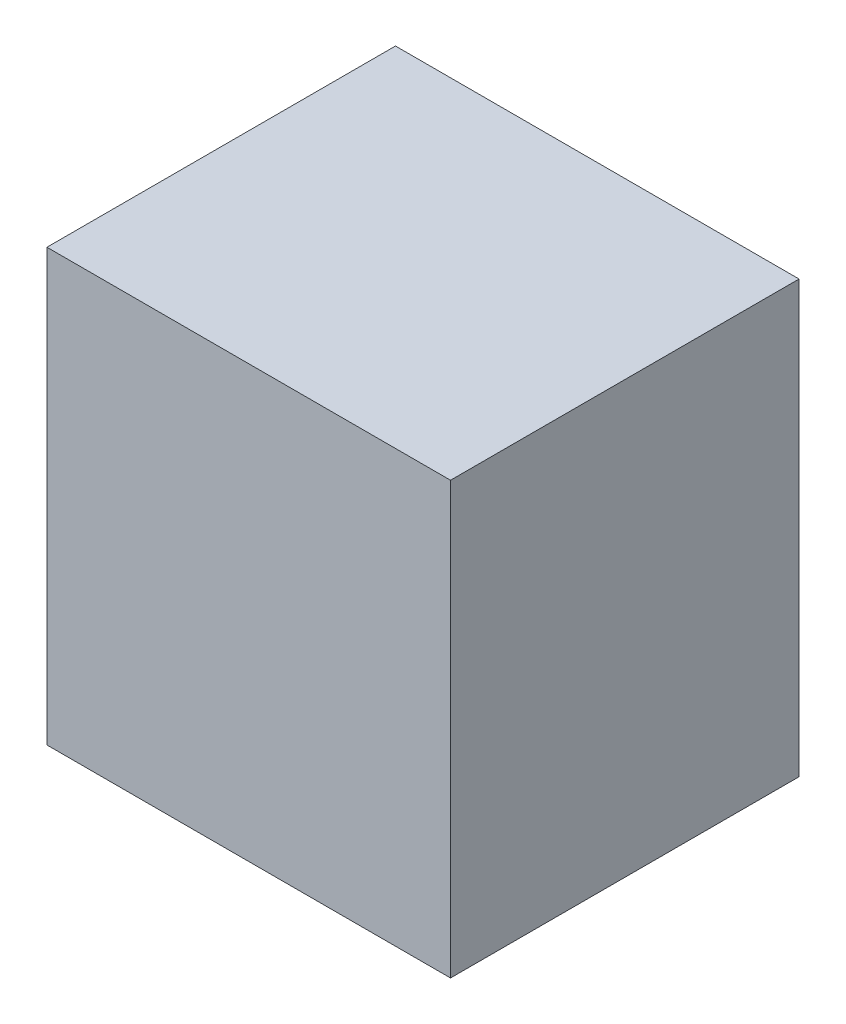
ISO-10303-21;
HEADER;
FILE_DESCRIPTION(('STEP AP214'),'2;1');
FILE_NAME('part.step','',(''),(''),'','','');
FILE_SCHEMA(('AUTOMOTIVE_DESIGN { 1 0 10303 214 1 1 1 1 }'));
ENDSEC;
DATA;
#1=APPLICATION_CONTEXT('core data for automotive mechanical design processes');
#2=APPLICATION_PROTOCOL_DEFINITION('international standard','automotive_design',2000,#1);
#3=PRODUCT_CONTEXT('',#1,'mechanical');
#4=PRODUCT('Part','Part','',(#3));
#5=PRODUCT_RELATED_PRODUCT_CATEGORY('part','',(#4));
#6=PRODUCT_DEFINITION_FORMATION('','',#4);
#7=PRODUCT_DEFINITION_CONTEXT('part definition',#1,'design');
#8=PRODUCT_DEFINITION('design','',#6,#7);
#9=PRODUCT_DEFINITION_SHAPE('','',#8);
#10=(LENGTH_UNIT() NAMED_UNIT(*) SI_UNIT(.MILLI.,.METRE.));
#11=(NAMED_UNIT(*) PLANE_ANGLE_UNIT() SI_UNIT($,.RADIAN.));
#12=(NAMED_UNIT(*) SI_UNIT($,.STERADIAN.) SOLID_ANGLE_UNIT());
#13=UNCERTAINTY_MEASURE_WITH_UNIT(LENGTH_MEASURE(1.E-05),#10,'distance_accuracy_value','');
#14=(GEOMETRIC_REPRESENTATION_CONTEXT(3) GLOBAL_UNCERTAINTY_ASSIGNED_CONTEXT((#13)) GLOBAL_UNIT_ASSIGNED_CONTEXT((#10,
#11,#12)) REPRESENTATION_CONTEXT('',''));
#15=CARTESIAN_POINT('',(0.,0.,0.));
#16=DIRECTION('',(0.,0.,1.));
#17=DIRECTION('',(1.,0.,0.));
#18=AXIS2_PLACEMENT_3D('',#15,#16,#17);
#19=CARTESIAN_POINT('',(0.,94.,0.));
#20=DIRECTION('',(1.,0.,0.));
#21=DIRECTION('',(0.,0.,-1.));
#22=AXIS2_PLACEMENT_3D('',#19,#20,#21);
#23=PLANE('',#22);
#24=DIRECTION('',(0.,0.,1.));
#25=VECTOR('',#24,1.);
#26=CARTESIAN_POINT('',(0.,0.,0.));
#27=LINE('',#26,#25);
#28=CARTESIAN_POINT('',(0.,0.,-76.));
#29=VERTEX_POINT('',#28);
#30=CARTESIAN_POINT('',(0.,0.,0.));
#31=VERTEX_POINT('',#30);
#32=EDGE_CURVE('E111',#29,#31,#27,.T.);
#33=ORIENTED_EDGE('',*,*,#32,.T.);
#34=DIRECTION('',(0.,-1.,0.));
#35=VECTOR('',#34,1.);
#36=CARTESIAN_POINT('',(0.,94.,0.));
#37=LINE('',#36,#35);
#38=CARTESIAN_POINT('',(0.,94.,0.));
#39=VERTEX_POINT('',#38);
#40=EDGE_CURVE('E11',#39,#31,#37,.T.);
#41=ORIENTED_EDGE('',*,*,#40,.F.);
#42=DIRECTION('',(0.,0.,1.));
#43=VECTOR('',#42,1.);
#44=CARTESIAN_POINT('',(0.,94.,0.));
#45=LINE('',#44,#43);
#46=CARTESIAN_POINT('',(0.,94.,-76.));
#47=VERTEX_POINT('',#46);
#48=EDGE_CURVE('E95',#47,#39,#45,.T.);
#49=ORIENTED_EDGE('',*,*,#48,.F.);
#50=DIRECTION('',(0.,-1.,0.));
#51=VECTOR('',#50,1.);
#52=CARTESIAN_POINT('',(0.,94.,-76.));
#53=LINE('',#52,#51);
#54=EDGE_CURVE('E107',#47,#29,#53,.T.);
#55=ORIENTED_EDGE('',*,*,#54,.T.);
#56=EDGE_LOOP('',(#33,#41,#49,#55));
#57=FACE_BOUND('',#56,.T.);
#58=ADVANCED_FACE('F43',(#57),#23,.F.);
#59=CARTESIAN_POINT('',(0.,94.,0.));
#60=DIRECTION('',(0.,0.,-1.));
#61=DIRECTION('',(-1.,0.,0.));
#62=AXIS2_PLACEMENT_3D('',#59,#60,#61);
#63=PLANE('',#62);
#64=DIRECTION('',(1.,0.,0.));
#65=VECTOR('',#64,1.);
#66=CARTESIAN_POINT('',(0.,0.,0.));
#67=LINE('',#66,#65);
#68=CARTESIAN_POINT('',(88.,0.,0.));
#69=VERTEX_POINT('',#68);
#70=EDGE_CURVE('E100',#31,#69,#67,.T.);
#71=ORIENTED_EDGE('',*,*,#70,.T.);
#72=DIRECTION('',(0.,-1.,0.));
#73=VECTOR('',#72,1.);
#74=CARTESIAN_POINT('',(88.,94.,0.));
#75=LINE('',#74,#73);
#76=CARTESIAN_POINT('',(88.,94.,0.));
#77=VERTEX_POINT('',#76);
#78=EDGE_CURVE('E52',#77,#69,#75,.T.);
#79=ORIENTED_EDGE('',*,*,#78,.F.);
#80=DIRECTION('',(1.,0.,0.));
#81=VECTOR('',#80,1.);
#82=CARTESIAN_POINT('',(0.,94.,0.));
#83=LINE('',#82,#81);
#84=EDGE_CURVE('E90',#39,#77,#83,.T.);
#85=ORIENTED_EDGE('',*,*,#84,.F.);
#86=ORIENTED_EDGE('',*,*,#40,.T.);
#87=EDGE_LOOP('',(#71,#79,#85,#86));
#88=FACE_BOUND('',#87,.T.);
#89=ADVANCED_FACE('F99',(#88),#63,.F.);
#90=CARTESIAN_POINT('',(88.,94.,0.));
#91=DIRECTION('',(-1.,0.,0.));
#92=DIRECTION('',(0.,0.,1.));
#93=AXIS2_PLACEMENT_3D('',#90,#91,#92);
#94=PLANE('',#93);
#95=DIRECTION('',(0.,0.,-1.));
#96=VECTOR('',#95,1.);
#97=CARTESIAN_POINT('',(88.,0.,0.));
#98=LINE('',#97,#96);
#99=CARTESIAN_POINT('',(88.,0.,-76.));
#100=VERTEX_POINT('',#99);
#101=EDGE_CURVE('E77',#69,#100,#98,.T.);
#102=ORIENTED_EDGE('',*,*,#101,.T.);
#103=DIRECTION('',(0.,-1.,0.));
#104=VECTOR('',#103,1.);
#105=CARTESIAN_POINT('',(88.,94.,-76.));
#106=LINE('',#105,#104);
#107=CARTESIAN_POINT('',(88.,94.,-76.));
#108=VERTEX_POINT('',#107);
#109=EDGE_CURVE('E102',#108,#100,#106,.T.);
#110=ORIENTED_EDGE('',*,*,#109,.F.);
#111=DIRECTION('',(0.,0.,-1.));
#112=VECTOR('',#111,1.);
#113=CARTESIAN_POINT('',(88.,94.,0.));
#114=LINE('',#113,#112);
#115=EDGE_CURVE('E93',#77,#108,#114,.T.);
#116=ORIENTED_EDGE('',*,*,#115,.F.);
#117=ORIENTED_EDGE('',*,*,#78,.T.);
#118=EDGE_LOOP('',(#102,#110,#116,#117));
#119=FACE_BOUND('',#118,.T.);
#120=ADVANCED_FACE('F103',(#119),#94,.F.);
#121=CARTESIAN_POINT('',(0.,94.,-76.));
#122=DIRECTION('',(0.,0.,1.));
#123=DIRECTION('',(1.,0.,0.));
#124=AXIS2_PLACEMENT_3D('',#121,#122,#123);
#125=PLANE('',#124);
#126=DIRECTION('',(-1.,0.,0.));
#127=VECTOR('',#126,1.);
#128=CARTESIAN_POINT('',(0.,0.,-76.));
#129=LINE('',#128,#127);
#130=EDGE_CURVE('E83',#100,#29,#129,.T.);
#131=ORIENTED_EDGE('',*,*,#130,.T.);
#132=ORIENTED_EDGE('',*,*,#54,.F.);
#133=DIRECTION('',(-1.,0.,0.));
#134=VECTOR('',#133,1.);
#135=CARTESIAN_POINT('',(0.,94.,-76.));
#136=LINE('',#135,#134);
#137=EDGE_CURVE('E60',#108,#47,#136,.T.);
#138=ORIENTED_EDGE('',*,*,#137,.F.);
#139=ORIENTED_EDGE('',*,*,#109,.T.);
#140=EDGE_LOOP('',(#131,#132,#138,#139));
#141=FACE_BOUND('',#140,.T.);
#142=ADVANCED_FACE('F124',(#141),#125,.F.);
#143=CARTESIAN_POINT('',(0.,94.,0.));
#144=DIRECTION('',(0.,-1.,0.));
#145=DIRECTION('',(0.,0.,-1.));
#146=AXIS2_PLACEMENT_3D('',#143,#144,#145);
#147=PLANE('',#146);
#148=ORIENTED_EDGE('',*,*,#48,.T.);
#149=ORIENTED_EDGE('',*,*,#84,.T.);
#150=ORIENTED_EDGE('',*,*,#115,.T.);
#151=ORIENTED_EDGE('',*,*,#137,.T.);
#152=EDGE_LOOP('',(#148,#149,#150,#151));
#153=FACE_BOUND('',#152,.T.);
#154=ADVANCED_FACE('F91',(#153),#147,.F.);
#155=CARTESIAN_POINT('',(0.,0.,0.));
#156=DIRECTION('',(0.,-1.,0.));
#157=DIRECTION('',(0.,0.,-1.));
#158=AXIS2_PLACEMENT_3D('',#155,#156,#157);
#159=PLANE('',#158);
#160=ORIENTED_EDGE('',*,*,#32,.F.);
#161=ORIENTED_EDGE('',*,*,#130,.F.);
#162=ORIENTED_EDGE('',*,*,#101,.F.);
#163=ORIENTED_EDGE('',*,*,#70,.F.);
#164=EDGE_LOOP('',(#160,#161,#162,#163));
#165=FACE_BOUND('',#164,.T.);
#166=ADVANCED_FACE('F127',(#165),#159,.T.);
#167=CLOSED_SHELL('',(#58,#89,#120,#142,#154,#166));
#168=MANIFOLD_SOLID_BREP('B2',#167);
#169=ADVANCED_BREP_SHAPE_REPRESENTATION('',(#18,#168),#14);
#170=SHAPE_DEFINITION_REPRESENTATION(#9,#169);
ENDSEC;
END-ISO-10303-21;
